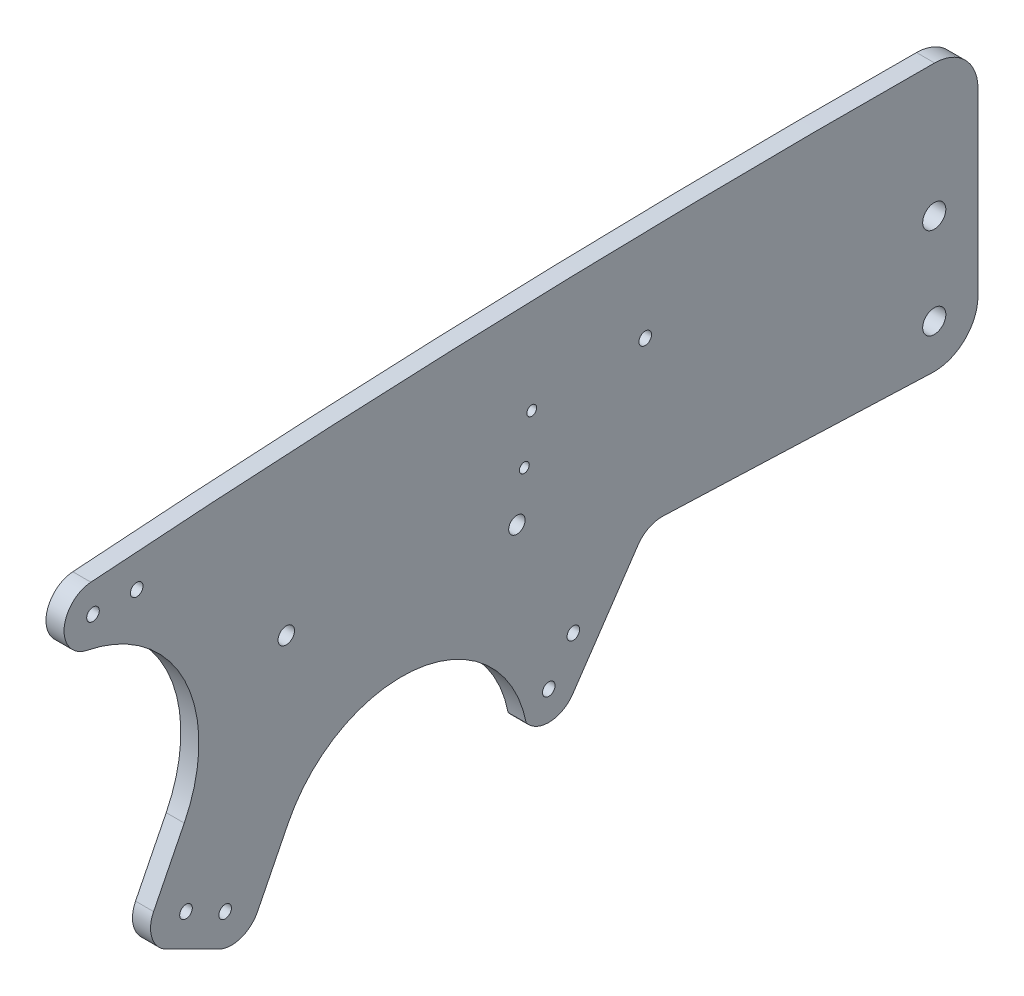
ISO-10303-21;
HEADER;
FILE_DESCRIPTION(('STEP AP214'),'2;1');
FILE_NAME('part.step','',(''),(''),'','','');
FILE_SCHEMA(('AUTOMOTIVE_DESIGN { 1 0 10303 214 1 1 1 1 }'));
ENDSEC;
DATA;
#1=APPLICATION_CONTEXT('core data for automotive mechanical design processes');
#2=APPLICATION_PROTOCOL_DEFINITION('international standard','automotive_design',2000,#1);
#3=PRODUCT_CONTEXT('',#1,'mechanical');
#4=PRODUCT('Part','Part','',(#3));
#5=PRODUCT_RELATED_PRODUCT_CATEGORY('part','',(#4));
#6=PRODUCT_DEFINITION_FORMATION('','',#4);
#7=PRODUCT_DEFINITION_CONTEXT('part definition',#1,'design');
#8=PRODUCT_DEFINITION('design','',#6,#7);
#9=PRODUCT_DEFINITION_SHAPE('','',#8);
#10=(LENGTH_UNIT() NAMED_UNIT(*) SI_UNIT(.MILLI.,.METRE.));
#11=(NAMED_UNIT(*) PLANE_ANGLE_UNIT() SI_UNIT($,.RADIAN.));
#12=(NAMED_UNIT(*) SI_UNIT($,.STERADIAN.) SOLID_ANGLE_UNIT());
#13=UNCERTAINTY_MEASURE_WITH_UNIT(LENGTH_MEASURE(1.E-05),#10,'distance_accuracy_value','');
#14=(GEOMETRIC_REPRESENTATION_CONTEXT(3) GLOBAL_UNCERTAINTY_ASSIGNED_CONTEXT((#13)) GLOBAL_UNIT_ASSIGNED_CONTEXT((#10,
#11,#12)) REPRESENTATION_CONTEXT('',''));
#15=CARTESIAN_POINT('',(0.,0.,0.));
#16=DIRECTION('',(0.,0.,1.));
#17=DIRECTION('',(1.,0.,0.));
#18=AXIS2_PLACEMENT_3D('',#15,#16,#17);
#19=CARTESIAN_POINT('',(4.953,-32.7611872371542,354.680554334521));
#20=DIRECTION('',(1.,0.,0.));
#21=DIRECTION('',(0.,0.,-1.));
#22=AXIS2_PLACEMENT_3D('',#19,#20,#21);
#23=PLANE('',#22);
#24=CARTESIAN_POINT('',(4.953,-53.2898683118976,485.252549027286));
#25=DIRECTION('',(1.,0.,0.));
#26=DIRECTION('',(0.,0.,-1.));
#27=AXIS2_PLACEMENT_3D('',#24,#25,#26);
#28=CIRCLE('',#27,1.72719999999997);
#29=CARTESIAN_POINT('',(4.953,-53.2898683118976,483.525349027286));
#30=VERTEX_POINT('',#29);
#31=EDGE_CURVE('E664',#30,#30,#28,.T.);
#32=ORIENTED_EDGE('',*,*,#31,.F.);
#33=EDGE_LOOP('',(#32));
#34=FACE_BOUND('',#33,.T.);
#35=CARTESIAN_POINT('',(4.953,29.9682270325283,498.771367049348));
#36=DIRECTION('',(1.,0.,0.));
#37=DIRECTION('',(0.,0.,-1.));
#38=AXIS2_PLACEMENT_3D('',#35,#36,#37);
#39=CIRCLE('',#38,1.72719999999997);
#40=CARTESIAN_POINT('',(4.953,29.9682270325283,497.044167049348));
#41=VERTEX_POINT('',#40);
#42=EDGE_CURVE('E676',#41,#41,#39,.T.);
#43=ORIENTED_EDGE('',*,*,#42,.F.);
#44=EDGE_LOOP('',(#43));
#45=FACE_BOUND('',#44,.T.);
#46=CARTESIAN_POINT('',(4.953,-40.2511356494511,379.006254083328));
#47=DIRECTION('',(1.,0.,0.));
#48=DIRECTION('',(0.,0.,-1.));
#49=AXIS2_PLACEMENT_3D('',#46,#47,#48);
#50=CIRCLE('',#49,1.72719999999999);
#51=CARTESIAN_POINT('',(4.953,-40.2511356494511,377.279054083328));
#52=VERTEX_POINT('',#51);
#53=EDGE_CURVE('E717',#52,#52,#50,.T.);
#54=ORIENTED_EDGE('',*,*,#53,.F.);
#55=EDGE_LOOP('',(#54));
#56=FACE_BOUND('',#55,.T.);
#57=CARTESIAN_POINT('',(4.953,-50.185658720557,385.737171654481));
#58=DIRECTION('',(1.,0.,0.));
#59=DIRECTION('',(0.,0.,-1.));
#60=AXIS2_PLACEMENT_3D('',#57,#58,#59);
#61=CIRCLE('',#60,1.72719999999997);
#62=CARTESIAN_POINT('',(4.953,-50.185658720557,384.009971654481));
#63=VERTEX_POINT('',#62);
#64=EDGE_CURVE('E718',#63,#63,#61,.T.);
#65=ORIENTED_EDGE('',*,*,#64,.F.);
#66=EDGE_LOOP('',(#65));
#67=FACE_BOUND('',#66,.T.);
#68=CARTESIAN_POINT('',(4.953,18.3061282263118,390.419716853028));
#69=DIRECTION('',(1.,0.,0.));
#70=DIRECTION('',(0.,0.,-1.));
#71=AXIS2_PLACEMENT_3D('',#68,#69,#70);
#72=CIRCLE('',#71,1.35255002158136);
#73=CARTESIAN_POINT('',(4.953,18.3061282263118,389.067166831447));
#74=VERTEX_POINT('',#73);
#75=EDGE_CURVE('E724',#74,#74,#72,.T.);
#76=ORIENTED_EDGE('',*,*,#75,.F.);
#77=EDGE_LOOP('',(#76));
#78=FACE_BOUND('',#77,.T.);
#79=CARTESIAN_POINT('',(4.953,-6.76719297354006,394.480328138154));
#80=DIRECTION('',(1.,0.,0.));
#81=DIRECTION('',(0.,0.,-1.));
#82=AXIS2_PLACEMENT_3D('',#79,#80,#81);
#83=CIRCLE('',#82,2.25424999999999);
#84=CARTESIAN_POINT('',(4.953,-6.76719297354006,392.226078138154));
#85=VERTEX_POINT('',#84);
#86=EDGE_CURVE('E203',#85,#85,#83,.T.);
#87=ORIENTED_EDGE('',*,*,#86,.F.);
#88=EDGE_LOOP('',(#87));
#89=FACE_BOUND('',#88,.T.);
#90=CARTESIAN_POINT('',(4.953,-32.7611872371542,354.680554334521));
#91=DIRECTION('',(-1.,0.,0.));
#92=DIRECTION('',(0.,0.,-1.));
#93=AXIS2_PLACEMENT_3D('',#90,#91,#92);
#94=CIRCLE('',#93,7.99999999999897);
#95=CARTESIAN_POINT('',(4.953,-28.2739088563857,361.303569715256));
#96=VERTEX_POINT('',#95);
#97=CARTESIAN_POINT('',(4.953,-24.7672215054673,354.369890721241));
#98=VERTEX_POINT('',#97);
#99=EDGE_CURVE('E204',#96,#98,#94,.T.);
#100=ORIENTED_EDGE('',*,*,#99,.T.);
#101=DIRECTION('',(0.,-0.0388329516596951,-0.999245716460869));
#102=VECTOR('',#101,1.);
#103=CARTESIAN_POINT('',(4.953,-24.7672215054673,354.369890721241));
#104=LINE('',#103,#102);
#105=CARTESIAN_POINT('',(4.953,-27.639294256366,280.465995419916));
#106=VERTEX_POINT('',#105);
#107=EDGE_CURVE('E119',#98,#106,#104,.T.);
#108=ORIENTED_EDGE('',*,*,#107,.T.);
#109=CARTESIAN_POINT('',(4.953,-15.6483456588356,280.));
#110=DIRECTION('',(1.,0.,0.));
#111=DIRECTION('',(0.,0.,1.));
#112=AXIS2_PLACEMENT_3D('',#109,#110,#111);
#113=CIRCLE('',#112,12.);
#114=CARTESIAN_POINT('',(4.953,-15.6483456588356,268.));
#115=VERTEX_POINT('',#114);
#116=EDGE_CURVE('E217',#106,#115,#113,.T.);
#117=ORIENTED_EDGE('',*,*,#116,.T.);
#118=DIRECTION('',(0.,1.,0.));
#119=VECTOR('',#118,1.);
#120=CARTESIAN_POINT('',(4.953,33.6380456938623,268.));
#121=LINE('',#120,#119);
#122=CARTESIAN_POINT('',(4.953,33.6380456938623,268.));
#123=VERTEX_POINT('',#122);
#124=EDGE_CURVE('E219',#115,#123,#121,.T.);
#125=ORIENTED_EDGE('',*,*,#124,.T.);
#126=CARTESIAN_POINT('',(4.953,33.6380456938623,280.));
#127=DIRECTION('',(1.,0.,0.));
#128=DIRECTION('',(0.,0.,-1.));
#129=AXIS2_PLACEMENT_3D('',#126,#127,#128);
#130=CIRCLE('',#129,12.0000000000002);
#131=CARTESIAN_POINT('',(4.953,45.6376789125345,279.906177735357));
#132=VERTEX_POINT('',#131);
#133=EDGE_CURVE('E222',#123,#132,#130,.T.);
#134=ORIENTED_EDGE('',*,*,#133,.T.);
#135=CARTESIAN_POINT('',(4.953,-2797.93492372453,302.139392400577));
#136=DIRECTION('',(1.,0.,0.));
#137=DIRECTION('',(0.,0.,1.));
#138=AXIS2_PLACEMENT_3D('',#135,#136,#137);
#139=CIRCLE('',#138,2843.65951940497);
#140=CARTESIAN_POINT('',(4.953,38.0179068856692,511.354604219596));
#141=VERTEX_POINT('',#140);
#142=EDGE_CURVE('E225',#132,#141,#139,.T.);
#143=ORIENTED_EDGE('',*,*,#142,.T.);
#144=CARTESIAN_POINT('',(4.953,30.1019185476259,510.770622300354));
#145=DIRECTION('',(1.,0.,0.));
#146=DIRECTION('',(0.,0.,-1.));
#147=AXIS2_PLACEMENT_3D('',#144,#145,#146);
#148=CIRCLE('',#147,7.93750000000252);
#149=CARTESIAN_POINT('',(4.953,22.31826474198,512.325819935349));
#150=VERTEX_POINT('',#149);
#151=EDGE_CURVE('E233',#141,#150,#148,.T.);
#152=ORIENTED_EDGE('',*,*,#151,.T.);
#153=CARTESIAN_POINT('',(4.953,-15.0065003575197,519.783421192923));
#154=DIRECTION('',(-1.,0.,0.));
#155=DIRECTION('',(0.,0.,-1.));
#156=AXIS2_PLACEMENT_3D('',#153,#154,#155);
#157=CIRCLE('',#156,38.0624999999975);
#158=CARTESIAN_POINT('',(4.953,-32.0249578675477,485.73748149038));
#159=VERTEX_POINT('',#158);
#160=EDGE_CURVE('E235',#150,#159,#157,.T.);
#161=ORIENTED_EDGE('',*,*,#160,.T.);
#162=DIRECTION('',(0.,-0.894474606306604,0.447118752316033));
#163=VECTOR('',#162,1.);
#164=CARTESIAN_POINT('',(4.953,-32.0249578675479,485.73748149038));
#165=LINE('',#164,#163);
#166=CARTESIAN_POINT('',(4.953,-48.8447478119963,494.145147220805));
#167=VERTEX_POINT('',#166);
#168=EDGE_CURVE('E238',#159,#167,#165,.T.);
#169=ORIENTED_EDGE('',*,*,#168,.T.);
#170=CARTESIAN_POINT('',(4.953,-52.4216978305244,486.989350370353));
#171=DIRECTION('',(1.,0.,0.));
#172=DIRECTION('',(0.,0.,-1.));
#173=AXIS2_PLACEMENT_3D('',#170,#171,#172);
#174=CIRCLE('',#173,7.99999999999946);
#175=CARTESIAN_POINT('',(4.953,-59.5774946809771,490.566300388881));
#176=VERTEX_POINT('',#175);
#177=EDGE_CURVE('E241',#167,#176,#174,.T.);
#178=ORIENTED_EDGE('',*,*,#177,.T.);
#179=DIRECTION('',(0.,-0.447118752316036,-0.894474606306602));
#180=VECTOR('',#179,1.);
#181=CARTESIAN_POINT('',(4.953,-59.5774946809774,490.566300388881));
#182=LINE('',#181,#180);
#183=CARTESIAN_POINT('',(4.953,-66.6792606715157,476.359002427067));
#184=VERTEX_POINT('',#183);
#185=EDGE_CURVE('E248',#176,#184,#182,.T.);
#186=ORIENTED_EDGE('',*,*,#185,.T.);
#187=CARTESIAN_POINT('',(4.953,-59.5234638210631,472.782052408539));
#188=DIRECTION('',(1.,0.,0.));
#189=DIRECTION('',(0.,0.,-1.));
#190=AXIS2_PLACEMENT_3D('',#187,#188,#189);
#191=CIRCLE('',#190,7.99999999999985);
#192=CARTESIAN_POINT('',(4.953,-63.1004138395911,465.626255558086));
#193=VERTEX_POINT('',#192);
#194=EDGE_CURVE('E250',#184,#193,#191,.T.);
#195=ORIENTED_EDGE('',*,*,#194,.T.);
#196=DIRECTION('',(0.,0.894474606306604,-0.447118752316034));
#197=VECTOR('',#196,1.);
#198=CARTESIAN_POINT('',(4.953,-63.1004138395911,465.626255558086));
#199=LINE('',#198,#197);
#200=CARTESIAN_POINT('',(4.953,-46.2806238951434,457.218589827661));
#201=VERTEX_POINT('',#200);
#202=EDGE_CURVE('E162',#193,#201,#199,.T.);
#203=ORIENTED_EDGE('',*,*,#202,.T.);
#204=CARTESIAN_POINT('',(4.953,-61.8421896626251,426.087206182307));
#205=DIRECTION('',(-1.,0.,0.));
#206=DIRECTION('',(0.,0.,-1.));
#207=AXIS2_PLACEMENT_3D('',#204,#205,#206);
#208=CIRCLE('',#207,34.8040999999982);
#209=CARTESIAN_POINT('',(4.953,-55.1468529615088,391.933175040016));
#210=VERTEX_POINT('',#209);
#211=EDGE_CURVE('E156',#201,#210,#208,.T.);
#212=ORIENTED_EDGE('',*,*,#211,.T.);
#213=CARTESIAN_POINT('',(4.953,-50.185658720557,385.737171654481));
#214=DIRECTION('',(1.,0.,0.));
#215=DIRECTION('',(0.,0.,-1.));
#216=AXIS2_PLACEMENT_3D('',#213,#214,#215);
#217=CIRCLE('',#216,7.93750000000079);
#218=CARTESIAN_POINT('',(4.953,-54.6378802389763,379.165898581405));
#219=VERTEX_POINT('',#218);
#220=EDGE_CURVE('E160',#210,#219,#217,.T.);
#221=ORIENTED_EDGE('',*,*,#220,.T.);
#222=DIRECTION('',(0.,0.827876922592201,-0.560909797596073));
#223=VECTOR('',#222,1.);
#224=CARTESIAN_POINT('',(4.953,-54.6378802389763,379.165898581405));
#225=LINE('',#224,#223);
#226=EDGE_CURVE('E52',#219,#96,#225,.T.);
#227=ORIENTED_EDGE('',*,*,#226,.T.);
#228=EDGE_LOOP('',(#100,#108,#117,#125,#134,#143,#152,#161,#169,#178,#186,#195,#203,#212,#221,#227));
#229=FACE_BOUND('',#228,.T.);
#230=CARTESIAN_POINT('',(4.953,-1.41718755012804,457.754552289623));
#231=DIRECTION('',(1.,0.,0.));
#232=DIRECTION('',(0.,0.,-1.));
#233=AXIS2_PLACEMENT_3D('',#230,#231,#232);
#234=CIRCLE('',#233,2.25424999999999);
#235=CARTESIAN_POINT('',(4.953,-1.41718755012804,455.500302289623));
#236=VERTEX_POINT('',#235);
#237=EDGE_CURVE('E192',#236,#236,#234,.T.);
#238=ORIENTED_EDGE('',*,*,#237,.F.);
#239=EDGE_LOOP('',(#238));
#240=FACE_BOUND('',#239,.T.);
#241=CARTESIAN_POINT('',(4.953,30.1019185476259,510.770622300354));
#242=DIRECTION('',(1.,0.,0.));
#243=DIRECTION('',(0.,0.,-1.));
#244=AXIS2_PLACEMENT_3D('',#241,#242,#243);
#245=CIRCLE('',#244,1.72720000000008);
#246=CARTESIAN_POINT('',(4.953,30.1019185476259,509.043422300354));
#247=VERTEX_POINT('',#246);
#248=EDGE_CURVE('E733',#247,#247,#245,.T.);
#249=ORIENTED_EDGE('',*,*,#248,.F.);
#250=EDGE_LOOP('',(#249));
#251=FACE_BOUND('',#250,.T.);
#252=CARTESIAN_POINT('',(4.953,5.76946762638475,392.450022495594));
#253=DIRECTION('',(1.,0.,0.));
#254=DIRECTION('',(0.,0.,-1.));
#255=AXIS2_PLACEMENT_3D('',#252,#253,#254);
#256=CIRCLE('',#255,1.35255002158135);
#257=CARTESIAN_POINT('',(4.953,5.76946762638475,391.097472474013));
#258=VERTEX_POINT('',#257);
#259=EDGE_CURVE('E732',#258,#258,#256,.T.);
#260=ORIENTED_EDGE('',*,*,#259,.F.);
#261=EDGE_LOOP('',(#260));
#262=FACE_BOUND('',#261,.T.);
#263=CARTESIAN_POINT('',(4.953,-15.6483456588356,280.));
#264=DIRECTION('',(1.,0.,0.));
#265=DIRECTION('',(0.,0.,-1.));
#266=AXIS2_PLACEMENT_3D('',#263,#264,#265);
#267=CIRCLE('',#266,3.17499999999997);
#268=CARTESIAN_POINT('',(4.953,-15.6483456588356,276.825));
#269=VERTEX_POINT('',#268);
#270=EDGE_CURVE('E708',#269,#269,#267,.T.);
#271=ORIENTED_EDGE('',*,*,#270,.F.);
#272=EDGE_LOOP('',(#271));
#273=FACE_BOUND('',#272,.T.);
#274=CARTESIAN_POINT('',(4.953,19.9282164771804,359.276554144292));
#275=DIRECTION('',(1.,0.,0.));
#276=DIRECTION('',(0.,0.,-1.));
#277=AXIS2_PLACEMENT_3D('',#274,#275,#276);
#278=CIRCLE('',#277,1.72719999999997);
#279=CARTESIAN_POINT('',(4.953,19.9282164771804,357.549354144292));
#280=VERTEX_POINT('',#279);
#281=EDGE_CURVE('E686',#280,#280,#278,.T.);
#282=ORIENTED_EDGE('',*,*,#281,.F.);
#283=EDGE_LOOP('',(#282));
#284=FACE_BOUND('',#283,.T.);
#285=CARTESIAN_POINT('',(4.953,-58.65529333969,474.518853751606));
#286=DIRECTION('',(1.,0.,0.));
#287=DIRECTION('',(0.,0.,-1.));
#288=AXIS2_PLACEMENT_3D('',#285,#286,#287);
#289=CIRCLE('',#288,1.72719999999997);
#290=CARTESIAN_POINT('',(4.953,-58.65529333969,472.791653751606));
#291=VERTEX_POINT('',#290);
#292=EDGE_CURVE('E685',#291,#291,#289,.T.);
#293=ORIENTED_EDGE('',*,*,#292,.F.);
#294=EDGE_LOOP('',(#293));
#295=FACE_BOUND('',#294,.T.);
#296=CARTESIAN_POINT('',(4.953,9.35165434116442,280.));
#297=DIRECTION('',(1.,0.,0.));
#298=DIRECTION('',(0.,0.,-1.));
#299=AXIS2_PLACEMENT_3D('',#296,#297,#298);
#300=CIRCLE('',#299,3.17499999999997);
#301=CARTESIAN_POINT('',(4.953,9.35165434116442,276.825));
#302=VERTEX_POINT('',#301);
#303=EDGE_CURVE('E655',#302,#302,#300,.T.);
#304=ORIENTED_EDGE('',*,*,#303,.F.);
#305=EDGE_LOOP('',(#304));
#306=FACE_BOUND('',#305,.T.);
#307=ADVANCED_FACE('F35',(#34,#45,#56,#67,#78,#89,#229,#240,#251,#262,#273,#284,#295,#306),#23,.T.);
#308=CARTESIAN_POINT('',(0.,-32.7611872371542,354.680554334521));
#309=DIRECTION('',(1.,0.,0.));
#310=DIRECTION('',(0.,0.,-1.));
#311=AXIS2_PLACEMENT_3D('',#308,#309,#310);
#312=PLANE('',#311);
#313=CARTESIAN_POINT('',(0.,-32.7611872371542,354.680554334521));
#314=DIRECTION('',(-1.,0.,0.));
#315=DIRECTION('',(0.,0.,-1.));
#316=AXIS2_PLACEMENT_3D('',#313,#314,#315);
#317=CIRCLE('',#316,7.99999999999897);
#318=CARTESIAN_POINT('',(0.,-28.2739088563857,361.303569715256));
#319=VERTEX_POINT('',#318);
#320=CARTESIAN_POINT('',(0.,-24.7672215054673,354.369890721241));
#321=VERTEX_POINT('',#320);
#322=EDGE_CURVE('E197',#319,#321,#317,.T.);
#323=ORIENTED_EDGE('',*,*,#322,.F.);
#324=DIRECTION('',(0.,0.827876922592201,-0.560909797596073));
#325=VECTOR('',#324,1.);
#326=CARTESIAN_POINT('',(0.,-54.6378802389763,379.165898581405));
#327=LINE('',#326,#325);
#328=CARTESIAN_POINT('',(0.,-54.6378802389763,379.165898581405));
#329=VERTEX_POINT('',#328);
#330=EDGE_CURVE('E111',#329,#319,#327,.T.);
#331=ORIENTED_EDGE('',*,*,#330,.F.);
#332=CARTESIAN_POINT('',(0.,-50.185658720557,385.737171654481));
#333=DIRECTION('',(1.,0.,0.));
#334=DIRECTION('',(0.,0.,-1.));
#335=AXIS2_PLACEMENT_3D('',#332,#333,#334);
#336=CIRCLE('',#335,7.93750000000079);
#337=CARTESIAN_POINT('',(0.,-55.1468529615088,391.933175040016));
#338=VERTEX_POINT('',#337);
#339=EDGE_CURVE('E105',#338,#329,#336,.T.);
#340=ORIENTED_EDGE('',*,*,#339,.F.);
#341=CARTESIAN_POINT('',(0.,-61.8421896626251,426.087206182307));
#342=DIRECTION('',(-1.,0.,0.));
#343=DIRECTION('',(0.,0.,-1.));
#344=AXIS2_PLACEMENT_3D('',#341,#342,#343);
#345=CIRCLE('',#344,34.8040999999982);
#346=CARTESIAN_POINT('',(0.,-46.2806238951434,457.218589827661));
#347=VERTEX_POINT('',#346);
#348=EDGE_CURVE('E170',#347,#338,#345,.T.);
#349=ORIENTED_EDGE('',*,*,#348,.F.);
#350=DIRECTION('',(0.,0.894474606306604,-0.447118752316034));
#351=VECTOR('',#350,1.);
#352=CARTESIAN_POINT('',(0.,-63.1004138395911,465.626255558086));
#353=LINE('',#352,#351);
#354=CARTESIAN_POINT('',(0.,-63.1004138395911,465.626255558086));
#355=VERTEX_POINT('',#354);
#356=EDGE_CURVE('E269',#355,#347,#353,.T.);
#357=ORIENTED_EDGE('',*,*,#356,.F.);
#358=CARTESIAN_POINT('',(0.,-59.5234638210631,472.782052408539));
#359=DIRECTION('',(1.,0.,0.));
#360=DIRECTION('',(0.,0.,-1.));
#361=AXIS2_PLACEMENT_3D('',#358,#359,#360);
#362=CIRCLE('',#361,7.99999999999985);
#363=CARTESIAN_POINT('',(0.,-66.6792606715157,476.359002427067));
#364=VERTEX_POINT('',#363);
#365=EDGE_CURVE('E263',#364,#355,#362,.T.);
#366=ORIENTED_EDGE('',*,*,#365,.F.);
#367=DIRECTION('',(0.,-0.447118752316036,-0.894474606306602));
#368=VECTOR('',#367,1.);
#369=CARTESIAN_POINT('',(0.,-59.5774946809774,490.566300388881));
#370=LINE('',#369,#368);
#371=CARTESIAN_POINT('',(0.,-59.5774946809771,490.566300388881));
#372=VERTEX_POINT('',#371);
#373=EDGE_CURVE('E328',#372,#364,#370,.T.);
#374=ORIENTED_EDGE('',*,*,#373,.F.);
#375=CARTESIAN_POINT('',(0.,-52.4216978305244,486.989350370353));
#376=DIRECTION('',(1.,0.,0.));
#377=DIRECTION('',(0.,0.,-1.));
#378=AXIS2_PLACEMENT_3D('',#375,#376,#377);
#379=CIRCLE('',#378,7.99999999999946);
#380=CARTESIAN_POINT('',(0.,-48.8447478119963,494.145147220805));
#381=VERTEX_POINT('',#380);
#382=EDGE_CURVE('E326',#381,#372,#379,.T.);
#383=ORIENTED_EDGE('',*,*,#382,.F.);
#384=DIRECTION('',(0.,-0.894474606306604,0.447118752316033));
#385=VECTOR('',#384,1.);
#386=CARTESIAN_POINT('',(0.,-32.0249578675479,485.73748149038));
#387=LINE('',#386,#385);
#388=CARTESIAN_POINT('',(0.,-32.0249578675477,485.73748149038));
#389=VERTEX_POINT('',#388);
#390=EDGE_CURVE('E324',#389,#381,#387,.T.);
#391=ORIENTED_EDGE('',*,*,#390,.F.);
#392=CARTESIAN_POINT('',(0.,-15.0065003575197,519.783421192923));
#393=DIRECTION('',(-1.,0.,0.));
#394=DIRECTION('',(0.,0.,-1.));
#395=AXIS2_PLACEMENT_3D('',#392,#393,#394);
#396=CIRCLE('',#395,38.0624999999975);
#397=CARTESIAN_POINT('',(0.,22.31826474198,512.325819935349));
#398=VERTEX_POINT('',#397);
#399=EDGE_CURVE('E322',#398,#389,#396,.T.);
#400=ORIENTED_EDGE('',*,*,#399,.F.);
#401=CARTESIAN_POINT('',(0.,30.1019185476259,510.770622300354));
#402=DIRECTION('',(1.,0.,0.));
#403=DIRECTION('',(0.,0.,-1.));
#404=AXIS2_PLACEMENT_3D('',#401,#402,#403);
#405=CIRCLE('',#404,7.93750000000252);
#406=CARTESIAN_POINT('',(0.,38.0179068856692,511.354604219596));
#407=VERTEX_POINT('',#406);
#408=EDGE_CURVE('E320',#407,#398,#405,.T.);
#409=ORIENTED_EDGE('',*,*,#408,.F.);
#410=CARTESIAN_POINT('',(0.,-2797.93492372453,302.139392400577));
#411=DIRECTION('',(1.,0.,0.));
#412=DIRECTION('',(0.,0.,1.));
#413=AXIS2_PLACEMENT_3D('',#410,#411,#412);
#414=CIRCLE('',#413,2843.65951940497);
#415=CARTESIAN_POINT('',(0.,45.6376789125345,279.906177735357));
#416=VERTEX_POINT('',#415);
#417=EDGE_CURVE('E318',#416,#407,#414,.T.);
#418=ORIENTED_EDGE('',*,*,#417,.F.);
#419=CARTESIAN_POINT('',(0.,33.6380456938623,280.));
#420=DIRECTION('',(1.,0.,0.));
#421=DIRECTION('',(0.,0.,-1.));
#422=AXIS2_PLACEMENT_3D('',#419,#420,#421);
#423=CIRCLE('',#422,12.0000000000002);
#424=CARTESIAN_POINT('',(0.,33.6380456938623,268.));
#425=VERTEX_POINT('',#424);
#426=EDGE_CURVE('E313',#425,#416,#423,.T.);
#427=ORIENTED_EDGE('',*,*,#426,.F.);
#428=DIRECTION('',(0.,1.,0.));
#429=VECTOR('',#428,1.);
#430=CARTESIAN_POINT('',(0.,33.6380456938623,268.));
#431=LINE('',#430,#429);
#432=CARTESIAN_POINT('',(0.,-15.6483456588356,268.));
#433=VERTEX_POINT('',#432);
#434=EDGE_CURVE('E311',#433,#425,#431,.T.);
#435=ORIENTED_EDGE('',*,*,#434,.F.);
#436=CARTESIAN_POINT('',(0.,-15.6483456588356,280.));
#437=DIRECTION('',(1.,0.,0.));
#438=DIRECTION('',(0.,0.,1.));
#439=AXIS2_PLACEMENT_3D('',#436,#437,#438);
#440=CIRCLE('',#439,12.);
#441=CARTESIAN_POINT('',(0.,-27.639294256366,280.465995419916));
#442=VERTEX_POINT('',#441);
#443=EDGE_CURVE('E303',#442,#433,#440,.T.);
#444=ORIENTED_EDGE('',*,*,#443,.F.);
#445=DIRECTION('',(0.,-0.0388329516596951,-0.999245716460869));
#446=VECTOR('',#445,1.);
#447=CARTESIAN_POINT('',(0.,-24.7672215054673,354.369890721241));
#448=LINE('',#447,#446);
#449=EDGE_CURVE('E309',#321,#442,#448,.T.);
#450=ORIENTED_EDGE('',*,*,#449,.F.);
#451=EDGE_LOOP('',(#323,#331,#340,#349,#357,#366,#374,#383,#391,#400,#409,#418,#427,#435,#444,#450));
#452=FACE_BOUND('',#451,.T.);
#453=CARTESIAN_POINT('',(0.,-1.41718755012804,457.754552289623));
#454=DIRECTION('',(1.,0.,0.));
#455=DIRECTION('',(0.,0.,-1.));
#456=AXIS2_PLACEMENT_3D('',#453,#454,#455);
#457=CIRCLE('',#456,2.25424999999999);
#458=CARTESIAN_POINT('',(0.,-1.41718755012804,455.500302289623));
#459=VERTEX_POINT('',#458);
#460=EDGE_CURVE('E198',#459,#459,#457,.T.);
#461=ORIENTED_EDGE('',*,*,#460,.T.);
#462=EDGE_LOOP('',(#461));
#463=FACE_BOUND('',#462,.T.);
#464=CARTESIAN_POINT('',(0.,-6.76719297354006,394.480328138154));
#465=DIRECTION('',(1.,0.,0.));
#466=DIRECTION('',(0.,0.,-1.));
#467=AXIS2_PLACEMENT_3D('',#464,#465,#466);
#468=CIRCLE('',#467,2.25424999999999);
#469=CARTESIAN_POINT('',(0.,-6.76719297354006,392.226078138154));
#470=VERTEX_POINT('',#469);
#471=EDGE_CURVE('E199',#470,#470,#468,.T.);
#472=ORIENTED_EDGE('',*,*,#471,.T.);
#473=EDGE_LOOP('',(#472));
#474=FACE_BOUND('',#473,.T.);
#475=CARTESIAN_POINT('',(0.,30.1019185476259,510.770622300354));
#476=DIRECTION('',(1.,0.,0.));
#477=DIRECTION('',(0.,0.,-1.));
#478=AXIS2_PLACEMENT_3D('',#475,#476,#477);
#479=CIRCLE('',#478,1.72720000000008);
#480=CARTESIAN_POINT('',(0.,30.1019185476259,509.043422300354));
#481=VERTEX_POINT('',#480);
#482=EDGE_CURVE('E729',#481,#481,#479,.T.);
#483=ORIENTED_EDGE('',*,*,#482,.T.);
#484=EDGE_LOOP('',(#483));
#485=FACE_BOUND('',#484,.T.);
#486=CARTESIAN_POINT('',(0.,18.3061282263118,390.419716853028));
#487=DIRECTION('',(1.,0.,0.));
#488=DIRECTION('',(0.,0.,-1.));
#489=AXIS2_PLACEMENT_3D('',#486,#487,#488);
#490=CIRCLE('',#489,1.35255002158136);
#491=CARTESIAN_POINT('',(0.,18.3061282263118,389.067166831447));
#492=VERTEX_POINT('',#491);
#493=EDGE_CURVE('E730',#492,#492,#490,.T.);
#494=ORIENTED_EDGE('',*,*,#493,.T.);
#495=EDGE_LOOP('',(#494));
#496=FACE_BOUND('',#495,.T.);
#497=CARTESIAN_POINT('',(0.,5.76946762638475,392.450022495594));
#498=DIRECTION('',(1.,0.,0.));
#499=DIRECTION('',(0.,0.,-1.));
#500=AXIS2_PLACEMENT_3D('',#497,#498,#499);
#501=CIRCLE('',#500,1.35255002158135);
#502=CARTESIAN_POINT('',(0.,5.76946762638475,391.097472474013));
#503=VERTEX_POINT('',#502);
#504=EDGE_CURVE('E722',#503,#503,#501,.T.);
#505=ORIENTED_EDGE('',*,*,#504,.T.);
#506=EDGE_LOOP('',(#505));
#507=FACE_BOUND('',#506,.T.);
#508=CARTESIAN_POINT('',(0.,-50.185658720557,385.737171654481));
#509=DIRECTION('',(1.,0.,0.));
#510=DIRECTION('',(0.,0.,-1.));
#511=AXIS2_PLACEMENT_3D('',#508,#509,#510);
#512=CIRCLE('',#511,1.72719999999997);
#513=CARTESIAN_POINT('',(0.,-50.185658720557,384.009971654481));
#514=VERTEX_POINT('',#513);
#515=EDGE_CURVE('E713',#514,#514,#512,.T.);
#516=ORIENTED_EDGE('',*,*,#515,.T.);
#517=EDGE_LOOP('',(#516));
#518=FACE_BOUND('',#517,.T.);
#519=CARTESIAN_POINT('',(0.,-15.6483456588356,280.));
#520=DIRECTION('',(1.,0.,0.));
#521=DIRECTION('',(0.,0.,-1.));
#522=AXIS2_PLACEMENT_3D('',#519,#520,#521);
#523=CIRCLE('',#522,3.17499999999997);
#524=CARTESIAN_POINT('',(0.,-15.6483456588356,276.825));
#525=VERTEX_POINT('',#524);
#526=EDGE_CURVE('E714',#525,#525,#523,.T.);
#527=ORIENTED_EDGE('',*,*,#526,.T.);
#528=EDGE_LOOP('',(#527));
#529=FACE_BOUND('',#528,.T.);
#530=CARTESIAN_POINT('',(0.,-40.2511356494511,379.006254083328));
#531=DIRECTION('',(1.,0.,0.));
#532=DIRECTION('',(0.,0.,-1.));
#533=AXIS2_PLACEMENT_3D('',#530,#531,#532);
#534=CIRCLE('',#533,1.72719999999999);
#535=CARTESIAN_POINT('',(0.,-40.2511356494511,377.279054083328));
#536=VERTEX_POINT('',#535);
#537=EDGE_CURVE('E690',#536,#536,#534,.T.);
#538=ORIENTED_EDGE('',*,*,#537,.T.);
#539=EDGE_LOOP('',(#538));
#540=FACE_BOUND('',#539,.T.);
#541=CARTESIAN_POINT('',(0.,19.9282164771804,359.276554144292));
#542=DIRECTION('',(1.,0.,0.));
#543=DIRECTION('',(0.,0.,-1.));
#544=AXIS2_PLACEMENT_3D('',#541,#542,#543);
#545=CIRCLE('',#544,1.72719999999997);
#546=CARTESIAN_POINT('',(0.,19.9282164771804,357.549354144292));
#547=VERTEX_POINT('',#546);
#548=EDGE_CURVE('E681',#547,#547,#545,.T.);
#549=ORIENTED_EDGE('',*,*,#548,.T.);
#550=EDGE_LOOP('',(#549));
#551=FACE_BOUND('',#550,.T.);
#552=CARTESIAN_POINT('',(0.,29.9682270325283,498.771367049348));
#553=DIRECTION('',(1.,0.,0.));
#554=DIRECTION('',(0.,0.,-1.));
#555=AXIS2_PLACEMENT_3D('',#552,#553,#554);
#556=CIRCLE('',#555,1.72719999999997);
#557=CARTESIAN_POINT('',(0.,29.9682270325283,497.044167049348));
#558=VERTEX_POINT('',#557);
#559=EDGE_CURVE('E682',#558,#558,#556,.T.);
#560=ORIENTED_EDGE('',*,*,#559,.T.);
#561=EDGE_LOOP('',(#560));
#562=FACE_BOUND('',#561,.T.);
#563=CARTESIAN_POINT('',(0.,-58.65529333969,474.518853751606));
#564=DIRECTION('',(1.,0.,0.));
#565=DIRECTION('',(0.,0.,-1.));
#566=AXIS2_PLACEMENT_3D('',#563,#564,#565);
#567=CIRCLE('',#566,1.72719999999997);
#568=CARTESIAN_POINT('',(0.,-58.65529333969,472.791653751606));
#569=VERTEX_POINT('',#568);
#570=EDGE_CURVE('E668',#569,#569,#567,.T.);
#571=ORIENTED_EDGE('',*,*,#570,.T.);
#572=EDGE_LOOP('',(#571));
#573=FACE_BOUND('',#572,.T.);
#574=CARTESIAN_POINT('',(0.,-53.2898683118976,485.252549027286));
#575=DIRECTION('',(1.,0.,0.));
#576=DIRECTION('',(0.,0.,-1.));
#577=AXIS2_PLACEMENT_3D('',#574,#575,#576);
#578=CIRCLE('',#577,1.72719999999997);
#579=CARTESIAN_POINT('',(0.,-53.2898683118976,483.525349027286));
#580=VERTEX_POINT('',#579);
#581=EDGE_CURVE('E661',#580,#580,#578,.T.);
#582=ORIENTED_EDGE('',*,*,#581,.T.);
#583=EDGE_LOOP('',(#582));
#584=FACE_BOUND('',#583,.T.);
#585=CARTESIAN_POINT('',(0.,9.35165434116442,280.));
#586=DIRECTION('',(1.,0.,0.));
#587=DIRECTION('',(0.,0.,-1.));
#588=AXIS2_PLACEMENT_3D('',#585,#586,#587);
#589=CIRCLE('',#588,3.17499999999997);
#590=CARTESIAN_POINT('',(0.,9.35165434116442,276.825));
#591=VERTEX_POINT('',#590);
#592=EDGE_CURVE('E658',#591,#591,#589,.T.);
#593=ORIENTED_EDGE('',*,*,#592,.T.);
#594=EDGE_LOOP('',(#593));
#595=FACE_BOUND('',#594,.T.);
#596=ADVANCED_FACE('F307',(#452,#463,#474,#485,#496,#507,#518,#529,#540,#551,#562,#573,#584,
#595),#312,.F.);
#597=CARTESIAN_POINT('',(4.953,-32.7611872371542,354.680554334521));
#598=DIRECTION('',(-1.,0.,0.));
#599=DIRECTION('',(0.,0.,1.));
#600=AXIS2_PLACEMENT_3D('',#597,#598,#599);
#601=CYLINDRICAL_SURFACE('',#600,7.99999999999897);
#602=ORIENTED_EDGE('',*,*,#322,.T.);
#603=DIRECTION('',(-1.,0.,0.));
#604=VECTOR('',#603,1.);
#605=CARTESIAN_POINT('',(4.953,-24.7672215054673,354.369890721241));
#606=LINE('',#605,#604);
#607=EDGE_CURVE('E12',#98,#321,#606,.T.);
#608=ORIENTED_EDGE('',*,*,#607,.F.);
#609=ORIENTED_EDGE('',*,*,#99,.F.);
#610=DIRECTION('',(-1.,0.,0.));
#611=VECTOR('',#610,1.);
#612=CARTESIAN_POINT('',(4.953,-28.2739088563857,361.303569715256));
#613=LINE('',#612,#611);
#614=EDGE_CURVE('E176',#96,#319,#613,.T.);
#615=ORIENTED_EDGE('',*,*,#614,.T.);
#616=EDGE_LOOP('',(#602,#608,#609,#615));
#617=FACE_BOUND('',#616,.T.);
#618=ADVANCED_FACE('F37',(#617),#601,.F.);
#619=CARTESIAN_POINT('',(4.953,-24.7672215054673,354.369890721241));
#620=DIRECTION('',(0.,0.999245716460869,-0.0388329516596951));
#621=DIRECTION('',(0.,0.0388329516596951,0.999245716460869));
#622=AXIS2_PLACEMENT_3D('',#619,#620,#621);
#623=PLANE('',#622);
#624=ORIENTED_EDGE('',*,*,#449,.T.);
#625=DIRECTION('',(-1.,0.,0.));
#626=VECTOR('',#625,1.);
#627=CARTESIAN_POINT('',(4.953,-27.639294256366,280.465995419916));
#628=LINE('',#627,#626);
#629=EDGE_CURVE('E44',#106,#442,#628,.T.);
#630=ORIENTED_EDGE('',*,*,#629,.F.);
#631=ORIENTED_EDGE('',*,*,#107,.F.);
#632=ORIENTED_EDGE('',*,*,#607,.T.);
#633=EDGE_LOOP('',(#624,#630,#631,#632));
#634=FACE_BOUND('',#633,.T.);
#635=ADVANCED_FACE('F618',(#634),#623,.F.);
#636=CARTESIAN_POINT('',(4.953,-15.6483456588356,280.));
#637=DIRECTION('',(-1.,0.,0.));
#638=DIRECTION('',(0.,0.,1.));
#639=AXIS2_PLACEMENT_3D('',#636,#637,#638);
#640=CYLINDRICAL_SURFACE('',#639,12.);
#641=ORIENTED_EDGE('',*,*,#443,.T.);
#642=DIRECTION('',(-1.,0.,0.));
#643=VECTOR('',#642,1.);
#644=CARTESIAN_POINT('',(4.953,-15.6483456588356,268.));
#645=LINE('',#644,#643);
#646=EDGE_CURVE('E295',#115,#433,#645,.T.);
#647=ORIENTED_EDGE('',*,*,#646,.F.);
#648=ORIENTED_EDGE('',*,*,#116,.F.);
#649=ORIENTED_EDGE('',*,*,#629,.T.);
#650=EDGE_LOOP('',(#641,#647,#648,#649));
#651=FACE_BOUND('',#650,.T.);
#652=ADVANCED_FACE('F301',(#651),#640,.T.);
#653=CARTESIAN_POINT('',(4.953,33.6380456938623,268.));
#654=DIRECTION('',(0.,0.,1.));
#655=DIRECTION('',(0.,-1.,0.));
#656=AXIS2_PLACEMENT_3D('',#653,#654,#655);
#657=PLANE('',#656);
#658=ORIENTED_EDGE('',*,*,#434,.T.);
#659=DIRECTION('',(-1.,0.,0.));
#660=VECTOR('',#659,1.);
#661=CARTESIAN_POINT('',(4.953,33.6380456938623,268.));
#662=LINE('',#661,#660);
#663=EDGE_CURVE('E292',#123,#425,#662,.T.);
#664=ORIENTED_EDGE('',*,*,#663,.F.);
#665=ORIENTED_EDGE('',*,*,#124,.F.);
#666=ORIENTED_EDGE('',*,*,#646,.T.);
#667=EDGE_LOOP('',(#658,#664,#665,#666));
#668=FACE_BOUND('',#667,.T.);
#669=ADVANCED_FACE('F343',(#668),#657,.F.);
#670=CARTESIAN_POINT('',(4.953,33.6380456938623,280.));
#671=DIRECTION('',(-1.,0.,0.));
#672=DIRECTION('',(0.,0.,1.));
#673=AXIS2_PLACEMENT_3D('',#670,#671,#672);
#674=CYLINDRICAL_SURFACE('',#673,12.0000000000002);
#675=ORIENTED_EDGE('',*,*,#426,.T.);
#676=DIRECTION('',(-1.,0.,0.));
#677=VECTOR('',#676,1.);
#678=CARTESIAN_POINT('',(4.953,45.6376789125345,279.906177735357));
#679=LINE('',#678,#677);
#680=EDGE_CURVE('E289',#132,#416,#679,.T.);
#681=ORIENTED_EDGE('',*,*,#680,.F.);
#682=ORIENTED_EDGE('',*,*,#133,.F.);
#683=ORIENTED_EDGE('',*,*,#663,.T.);
#684=EDGE_LOOP('',(#675,#681,#682,#683));
#685=FACE_BOUND('',#684,.T.);
#686=ADVANCED_FACE('F347',(#685),#674,.T.);
#687=CARTESIAN_POINT('',(4.953,-2797.93492372453,302.139392400577));
#688=DIRECTION('',(-1.,0.,0.));
#689=DIRECTION('',(0.,0.,1.));
#690=AXIS2_PLACEMENT_3D('',#687,#688,#689);
#691=CYLINDRICAL_SURFACE('',#690,2843.65951940497);
#692=ORIENTED_EDGE('',*,*,#417,.T.);
#693=DIRECTION('',(-1.,0.,0.));
#694=VECTOR('',#693,1.);
#695=CARTESIAN_POINT('',(4.953,38.0179068856692,511.354604219596));
#696=LINE('',#695,#694);
#697=EDGE_CURVE('E286',#141,#407,#696,.T.);
#698=ORIENTED_EDGE('',*,*,#697,.F.);
#699=ORIENTED_EDGE('',*,*,#142,.F.);
#700=ORIENTED_EDGE('',*,*,#680,.T.);
#701=EDGE_LOOP('',(#692,#698,#699,#700));
#702=FACE_BOUND('',#701,.T.);
#703=ADVANCED_FACE('F353',(#702),#691,.T.);
#704=CARTESIAN_POINT('',(4.953,30.1019185476259,510.770622300354));
#705=DIRECTION('',(-1.,0.,0.));
#706=DIRECTION('',(0.,0.,1.));
#707=AXIS2_PLACEMENT_3D('',#704,#705,#706);
#708=CYLINDRICAL_SURFACE('',#707,7.93750000000252);
#709=ORIENTED_EDGE('',*,*,#408,.T.);
#710=DIRECTION('',(-1.,0.,0.));
#711=VECTOR('',#710,1.);
#712=CARTESIAN_POINT('',(4.953,22.31826474198,512.325819935349));
#713=LINE('',#712,#711);
#714=EDGE_CURVE('E283',#150,#398,#713,.T.);
#715=ORIENTED_EDGE('',*,*,#714,.F.);
#716=ORIENTED_EDGE('',*,*,#151,.F.);
#717=ORIENTED_EDGE('',*,*,#697,.T.);
#718=EDGE_LOOP('',(#709,#715,#716,#717));
#719=FACE_BOUND('',#718,.T.);
#720=ADVANCED_FACE('F357',(#719),#708,.T.);
#721=CARTESIAN_POINT('',(4.953,-15.0065003575197,519.783421192923));
#722=DIRECTION('',(-1.,0.,0.));
#723=DIRECTION('',(0.,0.,1.));
#724=AXIS2_PLACEMENT_3D('',#721,#722,#723);
#725=CYLINDRICAL_SURFACE('',#724,38.0624999999975);
#726=ORIENTED_EDGE('',*,*,#399,.T.);
#727=DIRECTION('',(-1.,0.,0.));
#728=VECTOR('',#727,1.);
#729=CARTESIAN_POINT('',(4.953,-32.0249578675477,485.73748149038));
#730=LINE('',#729,#728);
#731=EDGE_CURVE('E280',#159,#389,#730,.T.);
#732=ORIENTED_EDGE('',*,*,#731,.F.);
#733=ORIENTED_EDGE('',*,*,#160,.F.);
#734=ORIENTED_EDGE('',*,*,#714,.T.);
#735=EDGE_LOOP('',(#726,#732,#733,#734));
#736=FACE_BOUND('',#735,.T.);
#737=ADVANCED_FACE('F362',(#736),#725,.F.);
#738=CARTESIAN_POINT('',(4.953,-32.0249578675479,485.73748149038));
#739=DIRECTION('',(0.,-0.447118752316033,-0.894474606306604));
#740=DIRECTION('',(0.,0.894474606306604,-0.447118752316033));
#741=AXIS2_PLACEMENT_3D('',#738,#739,#740);
#742=PLANE('',#741);
#743=ORIENTED_EDGE('',*,*,#390,.T.);
#744=DIRECTION('',(-1.,0.,0.));
#745=VECTOR('',#744,1.);
#746=CARTESIAN_POINT('',(4.953,-48.8447478119963,494.145147220805));
#747=LINE('',#746,#745);
#748=EDGE_CURVE('E277',#167,#381,#747,.T.);
#749=ORIENTED_EDGE('',*,*,#748,.F.);
#750=ORIENTED_EDGE('',*,*,#168,.F.);
#751=ORIENTED_EDGE('',*,*,#731,.T.);
#752=EDGE_LOOP('',(#743,#749,#750,#751));
#753=FACE_BOUND('',#752,.T.);
#754=ADVANCED_FACE('F368',(#753),#742,.F.);
#755=CARTESIAN_POINT('',(4.953,-52.4216978305244,486.989350370353));
#756=DIRECTION('',(-1.,0.,0.));
#757=DIRECTION('',(0.,0.,1.));
#758=AXIS2_PLACEMENT_3D('',#755,#756,#757);
#759=CYLINDRICAL_SURFACE('',#758,7.99999999999946);
#760=ORIENTED_EDGE('',*,*,#382,.T.);
#761=DIRECTION('',(-1.,0.,0.));
#762=VECTOR('',#761,1.);
#763=CARTESIAN_POINT('',(4.953,-59.5774946809771,490.566300388881));
#764=LINE('',#763,#762);
#765=EDGE_CURVE('E274',#176,#372,#764,.T.);
#766=ORIENTED_EDGE('',*,*,#765,.F.);
#767=ORIENTED_EDGE('',*,*,#177,.F.);
#768=ORIENTED_EDGE('',*,*,#748,.T.);
#769=EDGE_LOOP('',(#760,#766,#767,#768));
#770=FACE_BOUND('',#769,.T.);
#771=ADVANCED_FACE('F372',(#770),#759,.T.);
#772=CARTESIAN_POINT('',(4.953,-59.5774946809774,490.566300388881));
#773=DIRECTION('',(0.,0.894474606306602,-0.447118752316036));
#774=DIRECTION('',(0.,0.447118752316036,0.894474606306602));
#775=AXIS2_PLACEMENT_3D('',#772,#773,#774);
#776=PLANE('',#775);
#777=ORIENTED_EDGE('',*,*,#373,.T.);
#778=DIRECTION('',(-1.,0.,0.));
#779=VECTOR('',#778,1.);
#780=CARTESIAN_POINT('',(4.953,-66.6792606715157,476.359002427067));
#781=LINE('',#780,#779);
#782=EDGE_CURVE('E266',#184,#364,#781,.T.);
#783=ORIENTED_EDGE('',*,*,#782,.F.);
#784=ORIENTED_EDGE('',*,*,#185,.F.);
#785=ORIENTED_EDGE('',*,*,#765,.T.);
#786=EDGE_LOOP('',(#777,#783,#784,#785));
#787=FACE_BOUND('',#786,.T.);
#788=ADVANCED_FACE('F375',(#787),#776,.F.);
#789=CARTESIAN_POINT('',(4.953,-59.5234638210631,472.782052408539));
#790=DIRECTION('',(-1.,0.,0.));
#791=DIRECTION('',(0.,0.,1.));
#792=AXIS2_PLACEMENT_3D('',#789,#790,#791);
#793=CYLINDRICAL_SURFACE('',#792,7.99999999999985);
#794=ORIENTED_EDGE('',*,*,#365,.T.);
#795=DIRECTION('',(-1.,0.,0.));
#796=VECTOR('',#795,1.);
#797=CARTESIAN_POINT('',(4.953,-63.1004138395911,465.626255558086));
#798=LINE('',#797,#796);
#799=EDGE_CURVE('E260',#193,#355,#798,.T.);
#800=ORIENTED_EDGE('',*,*,#799,.F.);
#801=ORIENTED_EDGE('',*,*,#194,.F.);
#802=ORIENTED_EDGE('',*,*,#782,.T.);
#803=EDGE_LOOP('',(#794,#800,#801,#802));
#804=FACE_BOUND('',#803,.T.);
#805=ADVANCED_FACE('F261',(#804),#793,.T.);
#806=CARTESIAN_POINT('',(4.953,-63.1004138395911,465.626255558086));
#807=DIRECTION('',(0.,0.447118752316033,0.894474606306604));
#808=DIRECTION('',(0.,-0.894474606306604,0.447118752316033));
#809=AXIS2_PLACEMENT_3D('',#806,#807,#808);
#810=PLANE('',#809);
#811=ORIENTED_EDGE('',*,*,#356,.T.);
#812=DIRECTION('',(-1.,0.,0.));
#813=VECTOR('',#812,1.);
#814=CARTESIAN_POINT('',(4.953,-46.2806238951434,457.218589827661));
#815=LINE('',#814,#813);
#816=EDGE_CURVE('E171',#201,#347,#815,.T.);
#817=ORIENTED_EDGE('',*,*,#816,.F.);
#818=ORIENTED_EDGE('',*,*,#202,.F.);
#819=ORIENTED_EDGE('',*,*,#799,.T.);
#820=EDGE_LOOP('',(#811,#817,#818,#819));
#821=FACE_BOUND('',#820,.T.);
#822=ADVANCED_FACE('F268',(#821),#810,.F.);
#823=CARTESIAN_POINT('',(4.953,-61.8421896626251,426.087206182307));
#824=DIRECTION('',(-1.,0.,0.));
#825=DIRECTION('',(0.,0.,1.));
#826=AXIS2_PLACEMENT_3D('',#823,#824,#825);
#827=CYLINDRICAL_SURFACE('',#826,34.8040999999982);
#828=ORIENTED_EDGE('',*,*,#348,.T.);
#829=DIRECTION('',(-1.,0.,0.));
#830=VECTOR('',#829,1.);
#831=CARTESIAN_POINT('',(4.953,-55.1468529615088,391.933175040016));
#832=LINE('',#831,#830);
#833=EDGE_CURVE('E167',#210,#338,#832,.T.);
#834=ORIENTED_EDGE('',*,*,#833,.F.);
#835=ORIENTED_EDGE('',*,*,#211,.F.);
#836=ORIENTED_EDGE('',*,*,#816,.T.);
#837=EDGE_LOOP('',(#828,#834,#835,#836));
#838=FACE_BOUND('',#837,.T.);
#839=ADVANCED_FACE('F168',(#838),#827,.F.);
#840=CARTESIAN_POINT('',(4.953,-50.185658720557,385.737171654481));
#841=DIRECTION('',(-1.,0.,0.));
#842=DIRECTION('',(0.,0.,1.));
#843=AXIS2_PLACEMENT_3D('',#840,#841,#842);
#844=CYLINDRICAL_SURFACE('',#843,7.93750000000079);
#845=ORIENTED_EDGE('',*,*,#339,.T.);
#846=DIRECTION('',(-1.,0.,0.));
#847=VECTOR('',#846,1.);
#848=CARTESIAN_POINT('',(4.953,-54.6378802389763,379.165898581405));
#849=LINE('',#848,#847);
#850=EDGE_CURVE('E172',#219,#329,#849,.T.);
#851=ORIENTED_EDGE('',*,*,#850,.F.);
#852=ORIENTED_EDGE('',*,*,#220,.F.);
#853=ORIENTED_EDGE('',*,*,#833,.T.);
#854=EDGE_LOOP('',(#845,#851,#852,#853));
#855=FACE_BOUND('',#854,.T.);
#856=ADVANCED_FACE('F174',(#855),#844,.T.);
#857=CARTESIAN_POINT('',(4.953,-54.6378802389763,379.165898581405));
#858=DIRECTION('',(0.,0.560909797596073,0.827876922592201));
#859=DIRECTION('',(0.,-0.827876922592201,0.560909797596073));
#860=AXIS2_PLACEMENT_3D('',#857,#858,#859);
#861=PLANE('',#860);
#862=ORIENTED_EDGE('',*,*,#330,.T.);
#863=ORIENTED_EDGE('',*,*,#614,.F.);
#864=ORIENTED_EDGE('',*,*,#226,.F.);
#865=ORIENTED_EDGE('',*,*,#850,.T.);
#866=EDGE_LOOP('',(#862,#863,#864,#865));
#867=FACE_BOUND('',#866,.T.);
#868=ADVANCED_FACE('F335',(#867),#861,.F.);
#869=CARTESIAN_POINT('',(4.953,-1.41718755012804,457.754552289623));
#870=DIRECTION('',(-1.,0.,0.));
#871=DIRECTION('',(0.,0.,1.));
#872=AXIS2_PLACEMENT_3D('',#869,#870,#871);
#873=CYLINDRICAL_SURFACE('',#872,2.25424999999999);
#874=ORIENTED_EDGE('',*,*,#237,.T.);
#875=EDGE_LOOP('',(#874));
#876=FACE_BOUND('',#875,.T.);
#877=ORIENTED_EDGE('',*,*,#460,.F.);
#878=EDGE_LOOP('',(#877));
#879=FACE_BOUND('',#878,.T.);
#880=ADVANCED_FACE('F394',(#876,#879),#873,.F.);
#881=CARTESIAN_POINT('',(4.953,-6.76719297354006,394.480328138154));
#882=DIRECTION('',(-1.,0.,0.));
#883=DIRECTION('',(0.,0.,1.));
#884=AXIS2_PLACEMENT_3D('',#881,#882,#883);
#885=CYLINDRICAL_SURFACE('',#884,2.25424999999999);
#886=ORIENTED_EDGE('',*,*,#86,.T.);
#887=EDGE_LOOP('',(#886));
#888=FACE_BOUND('',#887,.T.);
#889=ORIENTED_EDGE('',*,*,#471,.F.);
#890=EDGE_LOOP('',(#889));
#891=FACE_BOUND('',#890,.T.);
#892=ADVANCED_FACE('F426',(#888,#891),#885,.F.);
#893=CARTESIAN_POINT('',(4.953,30.1019185476259,510.770622300354));
#894=DIRECTION('',(-1.,0.,0.));
#895=DIRECTION('',(0.,0.,1.));
#896=AXIS2_PLACEMENT_3D('',#893,#894,#895);
#897=CYLINDRICAL_SURFACE('',#896,1.72720000000008);
#898=ORIENTED_EDGE('',*,*,#248,.T.);
#899=EDGE_LOOP('',(#898));
#900=FACE_BOUND('',#899,.T.);
#901=ORIENTED_EDGE('',*,*,#482,.F.);
#902=EDGE_LOOP('',(#901));
#903=FACE_BOUND('',#902,.T.);
#904=ADVANCED_FACE('F433',(#900,#903),#897,.F.);
#905=CARTESIAN_POINT('',(4.953,18.3061282263118,390.419716853028));
#906=DIRECTION('',(-1.,0.,0.));
#907=DIRECTION('',(0.,0.,1.));
#908=AXIS2_PLACEMENT_3D('',#905,#906,#907);
#909=CYLINDRICAL_SURFACE('',#908,1.35255002158136);
#910=ORIENTED_EDGE('',*,*,#75,.T.);
#911=EDGE_LOOP('',(#910));
#912=FACE_BOUND('',#911,.T.);
#913=ORIENTED_EDGE('',*,*,#493,.F.);
#914=EDGE_LOOP('',(#913));
#915=FACE_BOUND('',#914,.T.);
#916=ADVANCED_FACE('F440',(#912,#915),#909,.F.);
#917=CARTESIAN_POINT('',(4.953,5.76946762638475,392.450022495594));
#918=DIRECTION('',(-1.,0.,0.));
#919=DIRECTION('',(0.,0.,1.));
#920=AXIS2_PLACEMENT_3D('',#917,#918,#919);
#921=CYLINDRICAL_SURFACE('',#920,1.35255002158135);
#922=ORIENTED_EDGE('',*,*,#259,.T.);
#923=EDGE_LOOP('',(#922));
#924=FACE_BOUND('',#923,.T.);
#925=ORIENTED_EDGE('',*,*,#504,.F.);
#926=EDGE_LOOP('',(#925));
#927=FACE_BOUND('',#926,.T.);
#928=ADVANCED_FACE('F448',(#924,#927),#921,.F.);
#929=CARTESIAN_POINT('',(4.953,-50.185658720557,385.737171654481));
#930=DIRECTION('',(-1.,0.,0.));
#931=DIRECTION('',(0.,0.,1.));
#932=AXIS2_PLACEMENT_3D('',#929,#930,#931);
#933=CYLINDRICAL_SURFACE('',#932,1.72719999999997);
#934=ORIENTED_EDGE('',*,*,#64,.T.);
#935=EDGE_LOOP('',(#934));
#936=FACE_BOUND('',#935,.T.);
#937=ORIENTED_EDGE('',*,*,#515,.F.);
#938=EDGE_LOOP('',(#937));
#939=FACE_BOUND('',#938,.T.);
#940=ADVANCED_FACE('F456',(#936,#939),#933,.F.);
#941=CARTESIAN_POINT('',(4.953,-15.6483456588356,280.));
#942=DIRECTION('',(-1.,0.,0.));
#943=DIRECTION('',(0.,0.,1.));
#944=AXIS2_PLACEMENT_3D('',#941,#942,#943);
#945=CYLINDRICAL_SURFACE('',#944,3.17499999999997);
#946=ORIENTED_EDGE('',*,*,#270,.T.);
#947=EDGE_LOOP('',(#946));
#948=FACE_BOUND('',#947,.T.);
#949=ORIENTED_EDGE('',*,*,#526,.F.);
#950=EDGE_LOOP('',(#949));
#951=FACE_BOUND('',#950,.T.);
#952=ADVANCED_FACE('F464',(#948,#951),#945,.F.);
#953=CARTESIAN_POINT('',(4.953,-40.2511356494511,379.006254083328));
#954=DIRECTION('',(-1.,0.,0.));
#955=DIRECTION('',(0.,0.,1.));
#956=AXIS2_PLACEMENT_3D('',#953,#954,#955);
#957=CYLINDRICAL_SURFACE('',#956,1.72719999999999);
#958=ORIENTED_EDGE('',*,*,#53,.T.);
#959=EDGE_LOOP('',(#958));
#960=FACE_BOUND('',#959,.T.);
#961=ORIENTED_EDGE('',*,*,#537,.F.);
#962=EDGE_LOOP('',(#961));
#963=FACE_BOUND('',#962,.T.);
#964=ADVANCED_FACE('F472',(#960,#963),#957,.F.);
#965=CARTESIAN_POINT('',(4.953,19.9282164771804,359.276554144292));
#966=DIRECTION('',(-1.,0.,0.));
#967=DIRECTION('',(0.,0.,1.));
#968=AXIS2_PLACEMENT_3D('',#965,#966,#967);
#969=CYLINDRICAL_SURFACE('',#968,1.72719999999997);
#970=ORIENTED_EDGE('',*,*,#281,.T.);
#971=EDGE_LOOP('',(#970));
#972=FACE_BOUND('',#971,.T.);
#973=ORIENTED_EDGE('',*,*,#548,.F.);
#974=EDGE_LOOP('',(#973));
#975=FACE_BOUND('',#974,.T.);
#976=ADVANCED_FACE('F480',(#972,#975),#969,.F.);
#977=CARTESIAN_POINT('',(4.953,29.9682270325283,498.771367049348));
#978=DIRECTION('',(-1.,0.,0.));
#979=DIRECTION('',(0.,0.,1.));
#980=AXIS2_PLACEMENT_3D('',#977,#978,#979);
#981=CYLINDRICAL_SURFACE('',#980,1.72719999999997);
#982=ORIENTED_EDGE('',*,*,#42,.T.);
#983=EDGE_LOOP('',(#982));
#984=FACE_BOUND('',#983,.T.);
#985=ORIENTED_EDGE('',*,*,#559,.F.);
#986=EDGE_LOOP('',(#985));
#987=FACE_BOUND('',#986,.T.);
#988=ADVANCED_FACE('F488',(#984,#987),#981,.F.);
#989=CARTESIAN_POINT('',(4.953,-58.65529333969,474.518853751606));
#990=DIRECTION('',(-1.,0.,0.));
#991=DIRECTION('',(0.,0.,1.));
#992=AXIS2_PLACEMENT_3D('',#989,#990,#991);
#993=CYLINDRICAL_SURFACE('',#992,1.72719999999997);
#994=ORIENTED_EDGE('',*,*,#292,.T.);
#995=EDGE_LOOP('',(#994));
#996=FACE_BOUND('',#995,.T.);
#997=ORIENTED_EDGE('',*,*,#570,.F.);
#998=EDGE_LOOP('',(#997));
#999=FACE_BOUND('',#998,.T.);
#1000=ADVANCED_FACE('F496',(#996,#999),#993,.F.);
#1001=CARTESIAN_POINT('',(4.953,-53.2898683118976,485.252549027286));
#1002=DIRECTION('',(-1.,0.,0.));
#1003=DIRECTION('',(0.,0.,1.));
#1004=AXIS2_PLACEMENT_3D('',#1001,#1002,#1003);
#1005=CYLINDRICAL_SURFACE('',#1004,1.72719999999997);
#1006=ORIENTED_EDGE('',*,*,#31,.T.);
#1007=EDGE_LOOP('',(#1006));
#1008=FACE_BOUND('',#1007,.T.);
#1009=ORIENTED_EDGE('',*,*,#581,.F.);
#1010=EDGE_LOOP('',(#1009));
#1011=FACE_BOUND('',#1010,.T.);
#1012=ADVANCED_FACE('F504',(#1008,#1011),#1005,.F.);
#1013=CARTESIAN_POINT('',(4.953,9.35165434116442,280.));
#1014=DIRECTION('',(-1.,0.,0.));
#1015=DIRECTION('',(0.,0.,1.));
#1016=AXIS2_PLACEMENT_3D('',#1013,#1014,#1015);
#1017=CYLINDRICAL_SURFACE('',#1016,3.17499999999997);
#1018=ORIENTED_EDGE('',*,*,#303,.T.);
#1019=EDGE_LOOP('',(#1018));
#1020=FACE_BOUND('',#1019,.T.);
#1021=ORIENTED_EDGE('',*,*,#592,.F.);
#1022=EDGE_LOOP('',(#1021));
#1023=FACE_BOUND('',#1022,.T.);
#1024=ADVANCED_FACE('F512',(#1020,#1023),#1017,.F.);
#1025=CLOSED_SHELL('',(#307,#596,#618,#635,#652,#669,#686,#703,#720,#737,#754,#771,#788,#805,
#822,#839,#856,#868,#880,#892,#904,#916,#928,#940,#952,#964,#976,#988,#1000,#1012,#1024));
#1026=MANIFOLD_SOLID_BREP('B2',#1025);
#1027=ADVANCED_BREP_SHAPE_REPRESENTATION('',(#18,#1026),#14);
#1028=SHAPE_DEFINITION_REPRESENTATION(#9,#1027);
ENDSEC;
END-ISO-10303-21;
